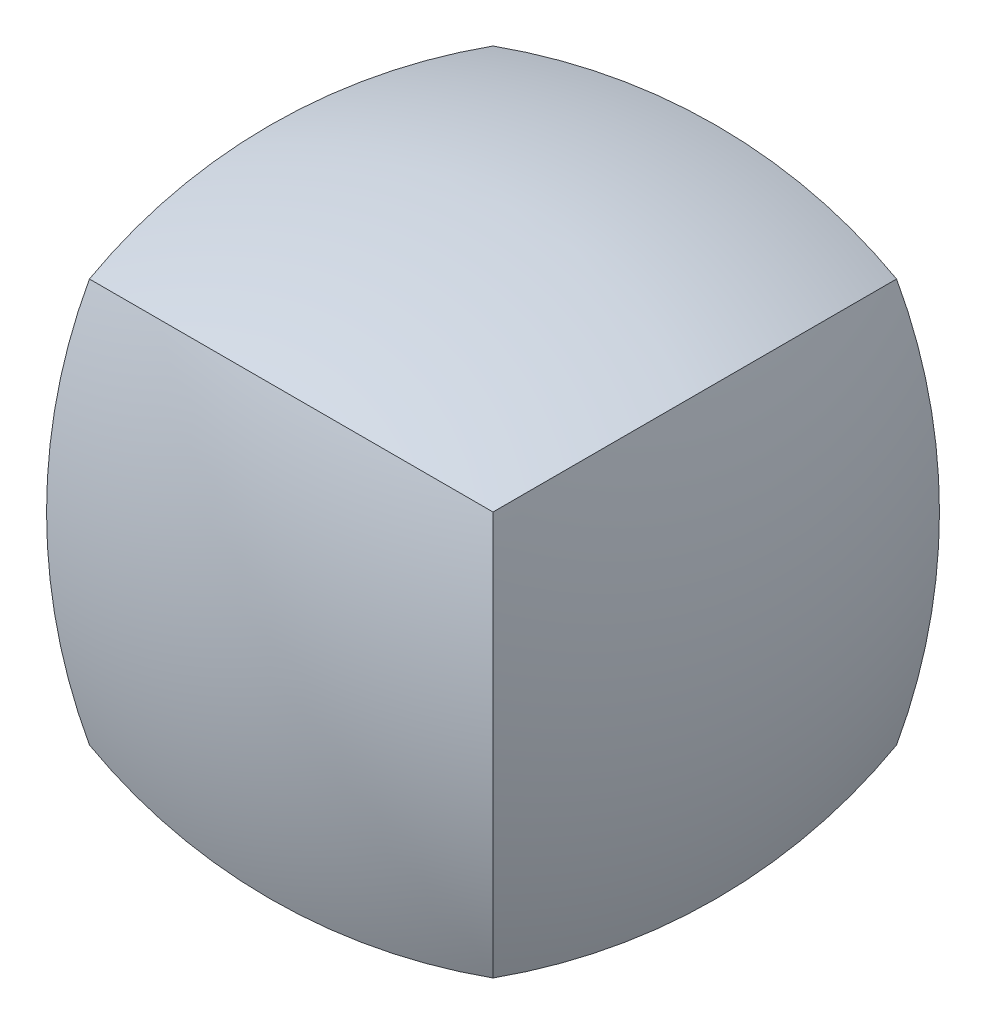
ISO-10303-21;
HEADER;
FILE_DESCRIPTION(('STEP AP214'),'2;1');
FILE_NAME('part.step','',(''),(''),'','','');
FILE_SCHEMA(('AUTOMOTIVE_DESIGN { 1 0 10303 214 1 1 1 1 }'));
ENDSEC;
DATA;
#1=APPLICATION_CONTEXT('core data for automotive mechanical design processes');
#2=APPLICATION_PROTOCOL_DEFINITION('international standard','automotive_design',2000,#1);
#3=PRODUCT_CONTEXT('',#1,'mechanical');
#4=PRODUCT('Part','Part','',(#3));
#5=PRODUCT_RELATED_PRODUCT_CATEGORY('part','',(#4));
#6=PRODUCT_DEFINITION_FORMATION('','',#4);
#7=PRODUCT_DEFINITION_CONTEXT('part definition',#1,'design');
#8=PRODUCT_DEFINITION('design','',#6,#7);
#9=PRODUCT_DEFINITION_SHAPE('','',#8);
#10=(LENGTH_UNIT() NAMED_UNIT(*) SI_UNIT(.MILLI.,.METRE.));
#11=(NAMED_UNIT(*) PLANE_ANGLE_UNIT() SI_UNIT($,.RADIAN.));
#12=(NAMED_UNIT(*) SI_UNIT($,.STERADIAN.) SOLID_ANGLE_UNIT());
#13=UNCERTAINTY_MEASURE_WITH_UNIT(LENGTH_MEASURE(1.E-05),#10,'distance_accuracy_value','');
#14=(GEOMETRIC_REPRESENTATION_CONTEXT(3) GLOBAL_UNCERTAINTY_ASSIGNED_CONTEXT((#13)) GLOBAL_UNIT_ASSIGNED_CONTEXT((#10,
#11,#12)) REPRESENTATION_CONTEXT('',''));
#15=CARTESIAN_POINT('',(0.,0.,0.));
#16=DIRECTION('',(0.,0.,1.));
#17=DIRECTION('',(1.,0.,0.));
#18=AXIS2_PLACEMENT_3D('',#15,#16,#17);
#19=CARTESIAN_POINT('',(-32.9955678841869,0.,1.15203476226446E-13));
#20=DIRECTION('',(0.,0.,1.));
#21=DIRECTION('',(1.,0.,0.));
#22=AXIS2_PLACEMENT_3D('',#19,#20,#21);
#23=SPHERICAL_SURFACE('',#22,49.0985226280625);
#24=CARTESIAN_POINT('',(-16.4977839420934,0.,16.4977839420935));
#25=DIRECTION('',(0.707106781186551,0.,0.707106781186544));
#26=DIRECTION('',(0.707106781186544,0.,-0.707106781186551));
#27=AXIS2_PLACEMENT_3D('',#24,#25,#26);
#28=CIRCLE('',#27,43.2008237682844);
#29=CARTESIAN_POINT('',(12.7000000000001,12.7000000000006,-12.7000000000001));
#30=VERTEX_POINT('',#29);
#31=CARTESIAN_POINT('',(12.7000000000002,-12.7000000000002,-12.7000000000003));
#32=VERTEX_POINT('',#31);
#33=EDGE_CURVE('E89',#30,#32,#28,.F.);
#34=ORIENTED_EDGE('',*,*,#33,.F.);
#35=CARTESIAN_POINT('',(-16.4977839420935,-16.4977839420934,-1.7280521438699E-13));
#36=DIRECTION('',(0.707106781186546,-0.707106781186549,0.));
#37=DIRECTION('',(-0.707106781186549,-0.707106781186546,0.));
#38=AXIS2_PLACEMENT_3D('',#35,#36,#37);
#39=CIRCLE('',#38,43.2008237682844);
#40=CARTESIAN_POINT('',(12.7000000000001,12.7000000000008,12.7000000000001));
#41=VERTEX_POINT('',#40);
#42=EDGE_CURVE('E84',#41,#30,#39,.F.);
#43=ORIENTED_EDGE('',*,*,#42,.F.);
#44=CARTESIAN_POINT('',(-16.4977839420935,0.,-16.4977839420934));
#45=DIRECTION('',(0.707106781186546,0.,-0.707106781186549));
#46=DIRECTION('',(-0.707106781186549,0.,-0.707106781186546));
#47=AXIS2_PLACEMENT_3D('',#44,#45,#46);
#48=CIRCLE('',#47,43.2008237682844);
#49=CARTESIAN_POINT('',(12.7000000000002,-12.7000000000002,12.7000000000002));
#50=VERTEX_POINT('',#49);
#51=EDGE_CURVE('E49',#50,#41,#48,.F.);
#52=ORIENTED_EDGE('',*,*,#51,.F.);
#53=CARTESIAN_POINT('',(-16.4977839420935,16.4977839420934,0.));
#54=DIRECTION('',(0.707106781186546,0.707106781186549,0.));
#55=DIRECTION('',(-0.707106781186549,0.707106781186546,0.));
#56=AXIS2_PLACEMENT_3D('',#53,#54,#55);
#57=CIRCLE('',#56,43.2008237682844);
#58=EDGE_CURVE('E111',#32,#50,#57,.F.);
#59=ORIENTED_EDGE('',*,*,#58,.F.);
#60=EDGE_LOOP('',(#34,#43,#52,#59));
#61=FACE_BOUND('',#60,.T.);
#62=ADVANCED_FACE('F46',(#61),#23,.T.);
#63=CARTESIAN_POINT('',(0.,0.,-32.9955678841869));
#64=DIRECTION('',(-1.,0.,0.));
#65=DIRECTION('',(0.,0.,1.));
#66=AXIS2_PLACEMENT_3D('',#63,#64,#65);
#67=SPHERICAL_SURFACE('',#66,49.0985226280625);
#68=ORIENTED_EDGE('',*,*,#51,.T.);
#69=CARTESIAN_POINT('',(0.,-16.4977839420932,-16.4977839420936));
#70=DIRECTION('',(0.,-0.707106781186556,0.707106781186539));
#71=DIRECTION('',(0.,-0.707106781186539,-0.707106781186556));
#72=AXIS2_PLACEMENT_3D('',#69,#70,#71);
#73=CIRCLE('',#72,43.2008237682844);
#74=CARTESIAN_POINT('',(-12.7,12.7000000000008,12.7000000000001));
#75=VERTEX_POINT('',#74);
#76=EDGE_CURVE('E92',#75,#41,#73,.F.);
#77=ORIENTED_EDGE('',*,*,#76,.F.);
#78=CARTESIAN_POINT('',(16.4977839420932,0.,-16.4977839420936));
#79=DIRECTION('',(0.707106781186556,0.,0.707106781186539));
#80=DIRECTION('',(0.707106781186539,0.,-0.707106781186556));
#81=AXIS2_PLACEMENT_3D('',#78,#79,#80);
#82=CIRCLE('',#81,43.2008237682844);
#83=CARTESIAN_POINT('',(-12.7000000000001,-12.7000000000002,12.7000000000005));
#84=VERTEX_POINT('',#83);
#85=EDGE_CURVE('E65',#84,#75,#82,.F.);
#86=ORIENTED_EDGE('',*,*,#85,.F.);
#87=CARTESIAN_POINT('',(0.,16.4977839420934,-16.4977839420934));
#88=DIRECTION('',(0.,0.707106781186546,0.707106781186549));
#89=DIRECTION('',(0.,-0.707106781186549,0.707106781186546));
#90=AXIS2_PLACEMENT_3D('',#87,#88,#89);
#91=CIRCLE('',#90,43.2008237682844);
#92=EDGE_CURVE('E96',#50,#84,#91,.F.);
#93=ORIENTED_EDGE('',*,*,#92,.F.);
#94=EDGE_LOOP('',(#68,#77,#86,#93));
#95=FACE_BOUND('',#94,.T.);
#96=ADVANCED_FACE('F94',(#95),#67,.T.);
#97=CARTESIAN_POINT('',(0.,-32.9955678841869,-3.45610428773981E-13));
#98=DIRECTION('',(-1.,0.,0.));
#99=DIRECTION('',(0.,1.,0.));
#100=AXIS2_PLACEMENT_3D('',#97,#98,#99);
#101=SPHERICAL_SURFACE('',#100,49.0985226280625);
#102=ORIENTED_EDGE('',*,*,#42,.T.);
#103=CARTESIAN_POINT('',(1.15203476226445E-13,-16.4977839420935,16.4977839420934));
#104=DIRECTION('',(0.,0.707106781186546,0.707106781186549));
#105=DIRECTION('',(0.,0.707106781186549,-0.707106781186546));
#106=AXIS2_PLACEMENT_3D('',#103,#104,#105);
#107=CIRCLE('',#106,43.2008237682844);
#108=CARTESIAN_POINT('',(-12.7000000000001,12.7000000000005,-12.7000000000006));
#109=VERTEX_POINT('',#108);
#110=EDGE_CURVE('E103',#109,#30,#107,.F.);
#111=ORIENTED_EDGE('',*,*,#110,.F.);
#112=CARTESIAN_POINT('',(16.4977839420934,-16.4977839420935,-1.72805214355442E-13));
#113=DIRECTION('',(0.707106781186549,0.707106781186546,0.));
#114=DIRECTION('',(-0.707106781186546,0.707106781186549,0.));
#115=AXIS2_PLACEMENT_3D('',#112,#113,#114);
#116=CIRCLE('',#115,43.2008237682844);
#117=EDGE_CURVE('E101',#75,#109,#116,.F.);
#118=ORIENTED_EDGE('',*,*,#117,.F.);
#119=ORIENTED_EDGE('',*,*,#76,.T.);
#120=EDGE_LOOP('',(#102,#111,#118,#119));
#121=FACE_BOUND('',#120,.T.);
#122=ADVANCED_FACE('F99',(#121),#101,.T.);
#123=CARTESIAN_POINT('',(2.30406952484439E-13,0.,32.9955678841869));
#124=DIRECTION('',(1.,0.,0.));
#125=DIRECTION('',(0.,0.,-1.));
#126=AXIS2_PLACEMENT_3D('',#123,#124,#125);
#127=SPHERICAL_SURFACE('',#126,49.0985226280625);
#128=CARTESIAN_POINT('',(16.4977839420935,0.,16.4977839420933));
#129=DIRECTION('',(0.707106781186541,0.,-0.707106781186554));
#130=DIRECTION('',(-0.707106781186554,0.,-0.707106781186541));
#131=AXIS2_PLACEMENT_3D('',#128,#129,#130);
#132=CIRCLE('',#131,43.2008237682844);
#133=CARTESIAN_POINT('',(-12.7000000000003,-12.7000000000002,-12.7000000000001));
#134=VERTEX_POINT('',#133);
#135=EDGE_CURVE('E56',#109,#134,#132,.F.);
#136=ORIENTED_EDGE('',*,*,#135,.F.);
#137=ORIENTED_EDGE('',*,*,#110,.T.);
#138=ORIENTED_EDGE('',*,*,#33,.T.);
#139=CARTESIAN_POINT('',(0.,16.4977839420933,16.4977839420935));
#140=DIRECTION('',(0.,0.707106781186551,-0.707106781186544));
#141=DIRECTION('',(0.,0.707106781186544,0.707106781186551));
#142=AXIS2_PLACEMENT_3D('',#139,#140,#141);
#143=CIRCLE('',#142,43.2008237682844);
#144=EDGE_CURVE('E113',#134,#32,#143,.F.);
#145=ORIENTED_EDGE('',*,*,#144,.F.);
#146=EDGE_LOOP('',(#136,#137,#138,#145));
#147=FACE_BOUND('',#146,.T.);
#148=ADVANCED_FACE('F137',(#147),#127,.T.);
#149=CARTESIAN_POINT('',(0.,32.9955678841869,1.15203476257994E-13));
#150=DIRECTION('',(-1.,0.,0.));
#151=DIRECTION('',(0.,-1.,0.));
#152=AXIS2_PLACEMENT_3D('',#149,#150,#151);
#153=SPHERICAL_SURFACE('',#152,49.0985226280625);
#154=ORIENTED_EDGE('',*,*,#58,.T.);
#155=ORIENTED_EDGE('',*,*,#92,.T.);
#156=CARTESIAN_POINT('',(16.4977839420934,16.4977839420935,-1.72805214355442E-13));
#157=DIRECTION('',(0.707106781186549,-0.707106781186546,0.));
#158=DIRECTION('',(0.707106781186546,0.707106781186549,0.));
#159=AXIS2_PLACEMENT_3D('',#156,#157,#158);
#160=CIRCLE('',#159,43.2008237682844);
#161=EDGE_CURVE('E12',#134,#84,#160,.F.);
#162=ORIENTED_EDGE('',*,*,#161,.F.);
#163=ORIENTED_EDGE('',*,*,#144,.T.);
#164=EDGE_LOOP('',(#154,#155,#162,#163));
#165=FACE_BOUND('',#164,.T.);
#166=ADVANCED_FACE('F139',(#165),#153,.T.);
#167=CARTESIAN_POINT('',(32.9955678841869,0.,-3.45610428742433E-13));
#168=DIRECTION('',(0.,0.,-1.));
#169=DIRECTION('',(-1.,0.,0.));
#170=AXIS2_PLACEMENT_3D('',#167,#168,#169);
#171=SPHERICAL_SURFACE('',#170,49.0985226280625);
#172=ORIENTED_EDGE('',*,*,#85,.T.);
#173=ORIENTED_EDGE('',*,*,#117,.T.);
#174=ORIENTED_EDGE('',*,*,#135,.T.);
#175=ORIENTED_EDGE('',*,*,#161,.T.);
#176=EDGE_LOOP('',(#172,#173,#174,#175));
#177=FACE_BOUND('',#176,.T.);
#178=ADVANCED_FACE('F132',(#177),#171,.T.);
#179=CLOSED_SHELL('',(#62,#96,#122,#148,#166,#178));
#180=MANIFOLD_SOLID_BREP('B2',#179);
#181=ADVANCED_BREP_SHAPE_REPRESENTATION('',(#18,#180),#14);
#182=SHAPE_DEFINITION_REPRESENTATION(#9,#181);
ENDSEC;
END-ISO-10303-21;
